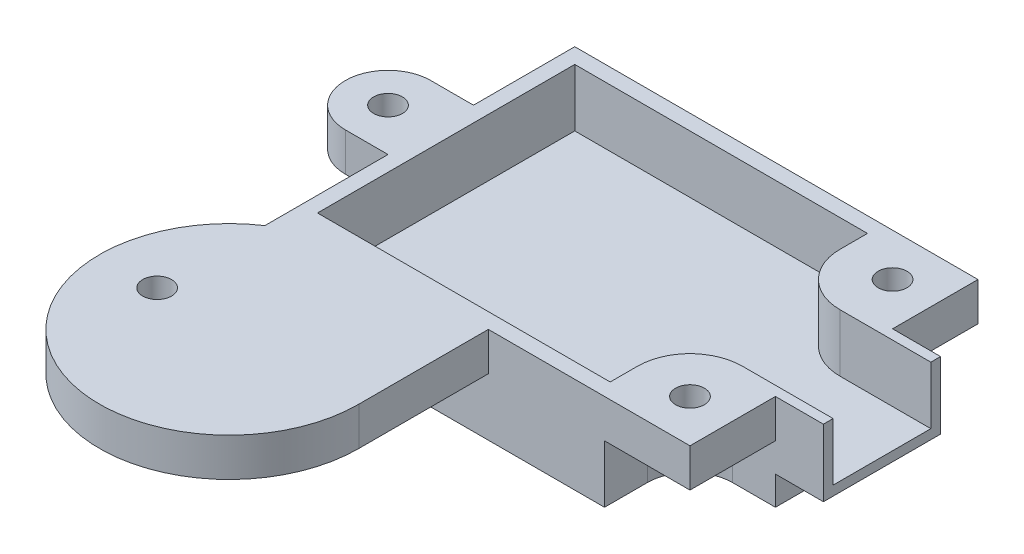
ISO-10303-21;
HEADER;
FILE_DESCRIPTION(('STEP AP214'),'2;1');
FILE_NAME('part.step','',(''),(''),'','','');
FILE_SCHEMA(('AUTOMOTIVE_DESIGN { 1 0 10303 214 1 1 1 1 }'));
ENDSEC;
DATA;
#1=APPLICATION_CONTEXT('core data for automotive mechanical design processes');
#2=APPLICATION_PROTOCOL_DEFINITION('international standard','automotive_design',2000,#1);
#3=PRODUCT_CONTEXT('',#1,'mechanical');
#4=PRODUCT('Part','Part','',(#3));
#5=PRODUCT_RELATED_PRODUCT_CATEGORY('part','',(#4));
#6=PRODUCT_DEFINITION_FORMATION('','',#4);
#7=PRODUCT_DEFINITION_CONTEXT('part definition',#1,'design');
#8=PRODUCT_DEFINITION('design','',#6,#7);
#9=PRODUCT_DEFINITION_SHAPE('','',#8);
#10=(LENGTH_UNIT() NAMED_UNIT(*) SI_UNIT(.MILLI.,.METRE.));
#11=(NAMED_UNIT(*) PLANE_ANGLE_UNIT() SI_UNIT($,.RADIAN.));
#12=(NAMED_UNIT(*) SI_UNIT($,.STERADIAN.) SOLID_ANGLE_UNIT());
#13=UNCERTAINTY_MEASURE_WITH_UNIT(LENGTH_MEASURE(1.E-05),#10,'distance_accuracy_value','');
#14=(GEOMETRIC_REPRESENTATION_CONTEXT(3) GLOBAL_UNCERTAINTY_ASSIGNED_CONTEXT((#13)) GLOBAL_UNIT_ASSIGNED_CONTEXT((#10,
#11,#12)) REPRESENTATION_CONTEXT('',''));
#15=CARTESIAN_POINT('',(0.,0.,0.));
#16=DIRECTION('',(0.,0.,1.));
#17=DIRECTION('',(1.,0.,0.));
#18=AXIS2_PLACEMENT_3D('',#15,#16,#17);
#19=CARTESIAN_POINT('',(42.,2.,0.));
#20=DIRECTION('',(-1.,0.,0.));
#21=DIRECTION('',(0.,0.,1.));
#22=AXIS2_PLACEMENT_3D('',#19,#20,#21);
#23=PLANE('',#22);
#24=DIRECTION('',(0.,-1.,0.));
#25=VECTOR('',#24,1.);
#26=CARTESIAN_POINT('',(42.,0.,-8.9));
#27=LINE('',#26,#25);
#28=CARTESIAN_POINT('',(42.,2.,-8.9));
#29=VERTEX_POINT('',#28);
#30=CARTESIAN_POINT('',(42.,-2.,-8.9));
#31=VERTEX_POINT('',#30);
#32=EDGE_CURVE('E282',#29,#31,#27,.T.);
#33=ORIENTED_EDGE('',*,*,#32,.F.);
#34=DIRECTION('',(0.,0.,-1.));
#35=VECTOR('',#34,1.);
#36=CARTESIAN_POINT('',(42.,2.,0.));
#37=LINE('',#36,#35);
#38=CARTESIAN_POINT('',(42.,2.,0.));
#39=VERTEX_POINT('',#38);
#40=EDGE_CURVE('E452',#39,#29,#37,.T.);
#41=ORIENTED_EDGE('',*,*,#40,.F.);
#42=DIRECTION('',(0.,-1.,0.));
#43=VECTOR('',#42,1.);
#44=CARTESIAN_POINT('',(42.,2.,0.));
#45=LINE('',#44,#43);
#46=CARTESIAN_POINT('',(42.,-2.,0.));
#47=VERTEX_POINT('',#46);
#48=EDGE_CURVE('E513',#39,#47,#45,.T.);
#49=ORIENTED_EDGE('',*,*,#48,.T.);
#50=DIRECTION('',(0.,0.,-1.));
#51=VECTOR('',#50,1.);
#52=CARTESIAN_POINT('',(42.,-2.,0.));
#53=LINE('',#52,#51);
#54=EDGE_CURVE('E489',#47,#31,#53,.T.);
#55=ORIENTED_EDGE('',*,*,#54,.T.);
#56=EDGE_LOOP('',(#33,#41,#49,#55));
#57=FACE_BOUND('',#56,.T.);
#58=ADVANCED_FACE('F41',(#57),#23,.F.);
#59=DIRECTION('',(0.,1.,0.));
#60=VECTOR('',#59,1.);
#61=CARTESIAN_POINT('',(42.,0.,-21.1));
#62=LINE('',#61,#60);
#63=CARTESIAN_POINT('',(42.,-2.,-21.1));
#64=VERTEX_POINT('',#63);
#65=CARTESIAN_POINT('',(42.,2.,-21.1));
#66=VERTEX_POINT('',#65);
#67=EDGE_CURVE('E11',#64,#66,#62,.T.);
#68=ORIENTED_EDGE('',*,*,#67,.F.);
#69=CARTESIAN_POINT('',(42.,-2.,-30.));
#70=VERTEX_POINT('',#69);
#71=EDGE_CURVE('E488',#64,#70,#53,.T.);
#72=ORIENTED_EDGE('',*,*,#71,.T.);
#73=DIRECTION('',(0.,-1.,0.));
#74=VECTOR('',#73,1.);
#75=CARTESIAN_POINT('',(42.,2.,-30.));
#76=LINE('',#75,#74);
#77=CARTESIAN_POINT('',(42.,2.,-30.));
#78=VERTEX_POINT('',#77);
#79=EDGE_CURVE('E510',#78,#70,#76,.T.);
#80=ORIENTED_EDGE('',*,*,#79,.F.);
#81=EDGE_CURVE('E451',#66,#78,#37,.T.);
#82=ORIENTED_EDGE('',*,*,#81,.F.);
#83=EDGE_LOOP('',(#68,#72,#80,#82));
#84=FACE_BOUND('',#83,.T.);
#85=ADVANCED_FACE('F560',(#84),#23,.F.);
#86=DIRECTION('',(0.,1.,0.));
#87=VECTOR('',#86,1.);
#88=CARTESIAN_POINT('',(42.,-8.,-21.1));
#89=LINE('',#88,#87);
#90=CARTESIAN_POINT('',(42.,-8.,-21.1));
#91=VERTEX_POINT('',#90);
#92=CARTESIAN_POINT('',(42.,-5.,-21.1));
#93=VERTEX_POINT('',#92);
#94=EDGE_CURVE('E58',#91,#93,#89,.T.);
#95=ORIENTED_EDGE('',*,*,#94,.T.);
#96=DIRECTION('',(0.,0.,1.));
#97=VECTOR('',#96,1.);
#98=CARTESIAN_POINT('',(42.,-5.,0.));
#99=LINE('',#98,#97);
#100=CARTESIAN_POINT('',(42.,-5.,-8.9));
#101=VERTEX_POINT('',#100);
#102=EDGE_CURVE('E63',#93,#101,#99,.T.);
#103=ORIENTED_EDGE('',*,*,#102,.T.);
#104=DIRECTION('',(0.,1.,0.));
#105=VECTOR('',#104,1.);
#106=CARTESIAN_POINT('',(42.,-8.,-8.9));
#107=LINE('',#106,#105);
#108=CARTESIAN_POINT('',(42.,-8.,-8.9));
#109=VERTEX_POINT('',#108);
#110=EDGE_CURVE('E424',#109,#101,#107,.T.);
#111=ORIENTED_EDGE('',*,*,#110,.F.);
#112=DIRECTION('',(0.,0.,1.));
#113=VECTOR('',#112,1.);
#114=CARTESIAN_POINT('',(42.,-8.,0.));
#115=LINE('',#114,#113);
#116=EDGE_CURVE('E379',#91,#109,#115,.T.);
#117=ORIENTED_EDGE('',*,*,#116,.F.);
#118=EDGE_LOOP('',(#95,#103,#111,#117));
#119=FACE_BOUND('',#118,.T.);
#120=ADVANCED_FACE('F563',(#119),#23,.F.);
#121=CARTESIAN_POINT('',(0.,2.,0.));
#122=DIRECTION('',(0.,1.,0.));
#123=DIRECTION('',(0.,0.,1.));
#124=AXIS2_PLACEMENT_3D('',#121,#122,#123);
#125=PLANE('',#124);
#126=CARTESIAN_POINT('',(37.55,2.,-4.45));
#127=DIRECTION('',(0.,1.,0.));
#128=DIRECTION('',(0.,0.,1.));
#129=AXIS2_PLACEMENT_3D('',#126,#127,#128);
#130=CIRCLE('',#129,1.5);
#131=CARTESIAN_POINT('',(37.55,2.,-2.95));
#132=VERTEX_POINT('',#131);
#133=EDGE_CURVE('E458',#132,#132,#130,.F.);
#134=ORIENTED_EDGE('',*,*,#133,.T.);
#135=EDGE_LOOP('',(#134));
#136=FACE_BOUND('',#135,.T.);
#137=CARTESIAN_POINT('',(37.55,2.,-25.55));
#138=DIRECTION('',(0.,1.,0.));
#139=DIRECTION('',(0.,0.,1.));
#140=AXIS2_PLACEMENT_3D('',#137,#138,#139);
#141=CIRCLE('',#140,1.5);
#142=CARTESIAN_POINT('',(37.55,2.,-24.05));
#143=VERTEX_POINT('',#142);
#144=EDGE_CURVE('E461',#143,#143,#141,.T.);
#145=ORIENTED_EDGE('',*,*,#144,.F.);
#146=EDGE_LOOP('',(#145));
#147=FACE_BOUND('',#146,.T.);
#148=CARTESIAN_POINT('',(-4.45,2.,-15.));
#149=DIRECTION('',(0.,1.,0.));
#150=DIRECTION('',(0.,0.,1.));
#151=AXIS2_PLACEMENT_3D('',#148,#149,#150);
#152=CIRCLE('',#151,1.5);
#153=CARTESIAN_POINT('',(-4.45,2.,-13.5));
#154=VERTEX_POINT('',#153);
#155=EDGE_CURVE('E464',#154,#154,#152,.T.);
#156=ORIENTED_EDGE('',*,*,#155,.F.);
#157=EDGE_LOOP('',(#156));
#158=FACE_BOUND('',#157,.T.);
#159=CARTESIAN_POINT('',(0.,2.,13.5));
#160=DIRECTION('',(0.,1.,0.));
#161=DIRECTION('',(0.,0.,1.));
#162=AXIS2_PLACEMENT_3D('',#159,#160,#161);
#163=CIRCLE('',#162,1.5);
#164=CARTESIAN_POINT('',(0.,2.,15.));
#165=VERTEX_POINT('',#164);
#166=EDGE_CURVE('E467',#165,#165,#163,.T.);
#167=ORIENTED_EDGE('',*,*,#166,.F.);
#168=EDGE_LOOP('',(#167));
#169=FACE_BOUND('',#168,.T.);
#170=CARTESIAN_POINT('',(37.55,2.,-25.55));
#171=DIRECTION('',(0.,1.,0.));
#172=DIRECTION('',(0.,0.,1.));
#173=AXIS2_PLACEMENT_3D('',#170,#171,#172);
#174=CIRCLE('',#173,5.46152532882695);
#175=CARTESIAN_POINT('',(32.088474671173,2.,-25.55));
#176=VERTEX_POINT('',#175);
#177=CARTESIAN_POINT('',(37.55,2.,-20.088474671173));
#178=VERTEX_POINT('',#177);
#179=EDGE_CURVE('E331',#176,#178,#174,.T.);
#180=ORIENTED_EDGE('',*,*,#179,.T.);
#181=DIRECTION('',(1.,0.,0.));
#182=VECTOR('',#181,1.);
#183=CARTESIAN_POINT('',(0.,2.,-20.088474671173));
#184=LINE('',#183,#182);
#185=CARTESIAN_POINT('',(47.,2.,-20.088474671173));
#186=VERTEX_POINT('',#185);
#187=EDGE_CURVE('E265',#178,#186,#184,.T.);
#188=ORIENTED_EDGE('',*,*,#187,.T.);
#189=DIRECTION('',(0.,0.,1.));
#190=VECTOR('',#189,1.);
#191=CARTESIAN_POINT('',(47.,2.,0.));
#192=LINE('',#191,#190);
#193=CARTESIAN_POINT('',(47.,2.,-21.1));
#194=VERTEX_POINT('',#193);
#195=EDGE_CURVE('E276',#194,#186,#192,.T.);
#196=ORIENTED_EDGE('',*,*,#195,.F.);
#197=DIRECTION('',(-1.,0.,0.));
#198=VECTOR('',#197,1.);
#199=CARTESIAN_POINT('',(47.,2.,-21.1));
#200=LINE('',#199,#198);
#201=EDGE_CURVE('E266',#194,#66,#200,.T.);
#202=ORIENTED_EDGE('',*,*,#201,.T.);
#203=ORIENTED_EDGE('',*,*,#81,.T.);
#204=DIRECTION('',(1.,0.,0.));
#205=VECTOR('',#204,1.);
#206=CARTESIAN_POINT('',(0.,2.,-30.));
#207=LINE('',#206,#205);
#208=CARTESIAN_POINT('',(0.,2.,-30.));
#209=VERTEX_POINT('',#208);
#210=EDGE_CURVE('E455',#209,#78,#207,.T.);
#211=ORIENTED_EDGE('',*,*,#210,.F.);
#212=DIRECTION('',(0.,0.,-1.));
#213=VECTOR('',#212,1.);
#214=CARTESIAN_POINT('',(0.,2.,0.));
#215=LINE('',#214,#213);
#216=CARTESIAN_POINT('',(0.,2.,-19.45));
#217=VERTEX_POINT('',#216);
#218=EDGE_CURVE('E445',#217,#209,#215,.T.);
#219=ORIENTED_EDGE('',*,*,#218,.F.);
#220=DIRECTION('',(1.,0.,0.));
#221=VECTOR('',#220,1.);
#222=CARTESIAN_POINT('',(0.,2.,-19.45));
#223=LINE('',#222,#221);
#224=CARTESIAN_POINT('',(-4.45,2.,-19.45));
#225=VERTEX_POINT('',#224);
#226=EDGE_CURVE('E433',#225,#217,#223,.T.);
#227=ORIENTED_EDGE('',*,*,#226,.F.);
#228=CARTESIAN_POINT('',(-4.45,2.,-15.));
#229=DIRECTION('',(0.,1.,0.));
#230=DIRECTION('',(0.,0.,1.));
#231=AXIS2_PLACEMENT_3D('',#228,#229,#230);
#232=CIRCLE('',#231,4.45);
#233=CARTESIAN_POINT('',(-4.45,2.,-10.55));
#234=VERTEX_POINT('',#233);
#235=EDGE_CURVE('E436',#225,#234,#232,.T.);
#236=ORIENTED_EDGE('',*,*,#235,.T.);
#237=DIRECTION('',(1.,0.,0.));
#238=VECTOR('',#237,1.);
#239=CARTESIAN_POINT('',(0.,2.,-10.55));
#240=LINE('',#239,#238);
#241=CARTESIAN_POINT('',(0.,2.,-10.55));
#242=VERTEX_POINT('',#241);
#243=EDGE_CURVE('E439',#234,#242,#240,.T.);
#244=ORIENTED_EDGE('',*,*,#243,.T.);
#245=CARTESIAN_POINT('',(0.,2.,2.27502783967818));
#246=VERTEX_POINT('',#245);
#247=EDGE_CURVE('E441',#246,#242,#215,.T.);
#248=ORIENTED_EDGE('',*,*,#247,.F.);
#249=CARTESIAN_POINT('',(7.5,2.,13.5));
#250=DIRECTION('',(0.,1.,0.));
#251=DIRECTION('',(0.,0.,1.));
#252=AXIS2_PLACEMENT_3D('',#249,#250,#251);
#253=CIRCLE('',#252,13.5);
#254=CARTESIAN_POINT('',(21.,2.,13.5));
#255=VERTEX_POINT('',#254);
#256=EDGE_CURVE('E444',#246,#255,#253,.T.);
#257=ORIENTED_EDGE('',*,*,#256,.T.);
#258=DIRECTION('',(0.,0.,-1.));
#259=VECTOR('',#258,1.);
#260=CARTESIAN_POINT('',(21.,2.,0.));
#261=LINE('',#260,#259);
#262=CARTESIAN_POINT('',(21.,2.,0.));
#263=VERTEX_POINT('',#262);
#264=EDGE_CURVE('E447',#255,#263,#261,.T.);
#265=ORIENTED_EDGE('',*,*,#264,.T.);
#266=DIRECTION('',(1.,0.,0.));
#267=VECTOR('',#266,1.);
#268=CARTESIAN_POINT('',(0.,2.,0.));
#269=LINE('',#268,#267);
#270=EDGE_CURVE('E449',#263,#39,#269,.T.);
#271=ORIENTED_EDGE('',*,*,#270,.T.);
#272=ORIENTED_EDGE('',*,*,#40,.T.);
#273=DIRECTION('',(-1.,0.,0.));
#274=VECTOR('',#273,1.);
#275=CARTESIAN_POINT('',(47.,2.,-8.9));
#276=LINE('',#275,#274);
#277=CARTESIAN_POINT('',(47.,2.,-8.9));
#278=VERTEX_POINT('',#277);
#279=EDGE_CURVE('E303',#278,#29,#276,.T.);
#280=ORIENTED_EDGE('',*,*,#279,.F.);
#281=DIRECTION('',(0.,0.,1.));
#282=VECTOR('',#281,1.);
#283=CARTESIAN_POINT('',(47.,2.,0.));
#284=LINE('',#283,#282);
#285=CARTESIAN_POINT('',(47.,2.,-9.91152532882695));
#286=VERTEX_POINT('',#285);
#287=EDGE_CURVE('E297',#286,#278,#284,.T.);
#288=ORIENTED_EDGE('',*,*,#287,.F.);
#289=DIRECTION('',(1.,0.,0.));
#290=VECTOR('',#289,1.);
#291=CARTESIAN_POINT('',(0.,2.,-9.91152532882695));
#292=LINE('',#291,#290);
#293=CARTESIAN_POINT('',(37.55,2.,-9.91152532882695));
#294=VERTEX_POINT('',#293);
#295=EDGE_CURVE('E310',#294,#286,#292,.T.);
#296=ORIENTED_EDGE('',*,*,#295,.F.);
#297=CARTESIAN_POINT('',(37.55,2.,-4.45));
#298=DIRECTION('',(0.,1.,0.));
#299=DIRECTION('',(0.,0.,1.));
#300=AXIS2_PLACEMENT_3D('',#297,#298,#299);
#301=CIRCLE('',#300,5.46152532882695);
#302=CARTESIAN_POINT('',(32.088474671173,2.,-4.45));
#303=VERTEX_POINT('',#302);
#304=EDGE_CURVE('E349',#294,#303,#301,.T.);
#305=ORIENTED_EDGE('',*,*,#304,.T.);
#306=DIRECTION('',(0.,0.,-1.));
#307=VECTOR('',#306,1.);
#308=CARTESIAN_POINT('',(32.088474671173,2.,0.));
#309=LINE('',#308,#307);
#310=CARTESIAN_POINT('',(32.088474671173,2.,-1.6));
#311=VERTEX_POINT('',#310);
#312=EDGE_CURVE('E346',#311,#303,#309,.T.);
#313=ORIENTED_EDGE('',*,*,#312,.F.);
#314=DIRECTION('',(1.,0.,0.));
#315=VECTOR('',#314,1.);
#316=CARTESIAN_POINT('',(0.,2.,-1.6));
#317=LINE('',#316,#315);
#318=CARTESIAN_POINT('',(1.6,2.,-1.6));
#319=VERTEX_POINT('',#318);
#320=EDGE_CURVE('E343',#319,#311,#317,.T.);
#321=ORIENTED_EDGE('',*,*,#320,.F.);
#322=DIRECTION('',(0.,0.,1.));
#323=VECTOR('',#322,1.);
#324=CARTESIAN_POINT('',(1.6,2.,0.));
#325=LINE('',#324,#323);
#326=CARTESIAN_POINT('',(1.6,2.,-28.4));
#327=VERTEX_POINT('',#326);
#328=EDGE_CURVE('E340',#327,#319,#325,.T.);
#329=ORIENTED_EDGE('',*,*,#328,.F.);
#330=DIRECTION('',(1.,0.,0.));
#331=VECTOR('',#330,1.);
#332=CARTESIAN_POINT('',(0.,2.,-28.4));
#333=LINE('',#332,#331);
#334=CARTESIAN_POINT('',(32.088474671173,2.,-28.4));
#335=VERTEX_POINT('',#334);
#336=EDGE_CURVE('E337',#327,#335,#333,.T.);
#337=ORIENTED_EDGE('',*,*,#336,.T.);
#338=DIRECTION('',(0.,0.,1.));
#339=VECTOR('',#338,1.);
#340=CARTESIAN_POINT('',(32.0884746711731,2.,0.));
#341=LINE('',#340,#339);
#342=EDGE_CURVE('E334',#335,#176,#341,.T.);
#343=ORIENTED_EDGE('',*,*,#342,.T.);
#344=EDGE_LOOP('',(#180,#188,#196,#202,#203,#211,#219,#227,#236,#244,#248,#257,#265,#271,#272,
#280,#288,#296,#305,#313,#321,#329,#337,#343));
#345=FACE_BOUND('',#344,.T.);
#346=ADVANCED_FACE('F572',(#136,#147,#158,#169,#345),#125,.T.);
#347=CARTESIAN_POINT('',(0.,-2.,0.));
#348=DIRECTION('',(0.,1.,0.));
#349=DIRECTION('',(0.,0.,1.));
#350=AXIS2_PLACEMENT_3D('',#347,#348,#349);
#351=PLANE('',#350);
#352=DIRECTION('',(0.,0.,-1.));
#353=VECTOR('',#352,1.);
#354=CARTESIAN_POINT('',(0.,-2.,0.));
#355=LINE('',#354,#353);
#356=CARTESIAN_POINT('',(0.,-2.,-10.55));
#357=VERTEX_POINT('',#356);
#358=CARTESIAN_POINT('',(0.,-2.,-19.45));
#359=VERTEX_POINT('',#358);
#360=EDGE_CURVE('E50',#357,#359,#355,.T.);
#361=ORIENTED_EDGE('',*,*,#360,.F.);
#362=DIRECTION('',(1.,0.,0.));
#363=VECTOR('',#362,1.);
#364=CARTESIAN_POINT('',(0.,-2.,-10.55));
#365=LINE('',#364,#363);
#366=CARTESIAN_POINT('',(-4.45,-2.,-10.55));
#367=VERTEX_POINT('',#366);
#368=EDGE_CURVE('E475',#367,#357,#365,.T.);
#369=ORIENTED_EDGE('',*,*,#368,.F.);
#370=CARTESIAN_POINT('',(-4.45,-2.,-15.));
#371=DIRECTION('',(0.,1.,0.));
#372=DIRECTION('',(0.,0.,1.));
#373=AXIS2_PLACEMENT_3D('',#370,#371,#372);
#374=CIRCLE('',#373,4.45);
#375=CARTESIAN_POINT('',(-4.45,-2.,-19.45));
#376=VERTEX_POINT('',#375);
#377=EDGE_CURVE('E473',#376,#367,#374,.T.);
#378=ORIENTED_EDGE('',*,*,#377,.F.);
#379=DIRECTION('',(1.,0.,0.));
#380=VECTOR('',#379,1.);
#381=CARTESIAN_POINT('',(0.,-2.,-19.45));
#382=LINE('',#381,#380);
#383=EDGE_CURVE('E432',#376,#359,#382,.T.);
#384=ORIENTED_EDGE('',*,*,#383,.T.);
#385=EDGE_LOOP('',(#361,#369,#378,#384));
#386=FACE_BOUND('',#385,.T.);
#387=CARTESIAN_POINT('',(-4.45,-2.,-15.));
#388=DIRECTION('',(0.,1.,0.));
#389=DIRECTION('',(0.,0.,1.));
#390=AXIS2_PLACEMENT_3D('',#387,#388,#389);
#391=CIRCLE('',#390,1.5);
#392=CARTESIAN_POINT('',(-4.45,-2.,-13.5));
#393=VERTEX_POINT('',#392);
#394=EDGE_CURVE('E501',#393,#393,#391,.T.);
#395=ORIENTED_EDGE('',*,*,#394,.T.);
#396=EDGE_LOOP('',(#395));
#397=FACE_BOUND('',#396,.T.);
#398=ADVANCED_FACE('F540',(#386,#397),#351,.F.);
#399=DIRECTION('',(-1.,0.,0.));
#400=VECTOR('',#399,1.);
#401=CARTESIAN_POINT('',(0.,-2.,0.));
#402=LINE('',#401,#400);
#403=CARTESIAN_POINT('',(21.,-2.,0.));
#404=VERTEX_POINT('',#403);
#405=CARTESIAN_POINT('',(0.,-2.,0.));
#406=VERTEX_POINT('',#405);
#407=EDGE_CURVE('E410',#404,#406,#402,.T.);
#408=ORIENTED_EDGE('',*,*,#407,.F.);
#409=DIRECTION('',(0.,0.,-1.));
#410=VECTOR('',#409,1.);
#411=CARTESIAN_POINT('',(21.,-2.,0.));
#412=LINE('',#411,#410);
#413=CARTESIAN_POINT('',(21.,-2.,13.5));
#414=VERTEX_POINT('',#413);
#415=EDGE_CURVE('E483',#414,#404,#412,.T.);
#416=ORIENTED_EDGE('',*,*,#415,.F.);
#417=CARTESIAN_POINT('',(7.5,-2.,13.5));
#418=DIRECTION('',(0.,1.,0.));
#419=DIRECTION('',(0.,0.,1.));
#420=AXIS2_PLACEMENT_3D('',#417,#418,#419);
#421=CIRCLE('',#420,13.5);
#422=CARTESIAN_POINT('',(0.,-2.,2.27502783967818));
#423=VERTEX_POINT('',#422);
#424=EDGE_CURVE('E481',#423,#414,#421,.T.);
#425=ORIENTED_EDGE('',*,*,#424,.F.);
#426=DIRECTION('',(0.,0.,-1.));
#427=VECTOR('',#426,1.);
#428=CARTESIAN_POINT('',(0.,-2.,0.));
#429=LINE('',#428,#427);
#430=EDGE_CURVE('E478',#423,#406,#429,.T.);
#431=ORIENTED_EDGE('',*,*,#430,.T.);
#432=EDGE_LOOP('',(#408,#416,#425,#431));
#433=FACE_BOUND('',#432,.T.);
#434=CARTESIAN_POINT('',(0.,-2.,13.5));
#435=DIRECTION('',(0.,1.,0.));
#436=DIRECTION('',(0.,0.,1.));
#437=AXIS2_PLACEMENT_3D('',#434,#435,#436);
#438=CIRCLE('',#437,1.5);
#439=CARTESIAN_POINT('',(0.,-2.,15.));
#440=VERTEX_POINT('',#439);
#441=EDGE_CURVE('E437',#440,#440,#438,.T.);
#442=ORIENTED_EDGE('',*,*,#441,.T.);
#443=EDGE_LOOP('',(#442));
#444=FACE_BOUND('',#443,.T.);
#445=ADVANCED_FACE('F584',(#433,#444),#351,.F.);
#446=CARTESIAN_POINT('',(37.55,-2.,-25.55));
#447=DIRECTION('',(0.,1.,0.));
#448=DIRECTION('',(0.,0.,1.));
#449=AXIS2_PLACEMENT_3D('',#446,#447,#448);
#450=CIRCLE('',#449,1.5);
#451=CARTESIAN_POINT('',(37.55,-2.,-24.05));
#452=VERTEX_POINT('',#451);
#453=EDGE_CURVE('E498',#452,#452,#450,.T.);
#454=ORIENTED_EDGE('',*,*,#453,.T.);
#455=EDGE_LOOP('',(#454));
#456=FACE_BOUND('',#455,.T.);
#457=CARTESIAN_POINT('',(37.55,-2.,-25.55));
#458=DIRECTION('',(0.,-1.,0.));
#459=DIRECTION('',(0.,0.,-1.));
#460=AXIS2_PLACEMENT_3D('',#457,#458,#459);
#461=CIRCLE('',#460,4.45);
#462=CARTESIAN_POINT('',(37.55,-2.,-21.1));
#463=VERTEX_POINT('',#462);
#464=CARTESIAN_POINT('',(33.1,-2.,-25.55));
#465=VERTEX_POINT('',#464);
#466=EDGE_CURVE('E399',#463,#465,#461,.T.);
#467=ORIENTED_EDGE('',*,*,#466,.T.);
#468=DIRECTION('',(0.,0.,-1.));
#469=VECTOR('',#468,1.);
#470=CARTESIAN_POINT('',(33.1,-2.,0.));
#471=LINE('',#470,#469);
#472=CARTESIAN_POINT('',(33.1,-2.,-30.));
#473=VERTEX_POINT('',#472);
#474=EDGE_CURVE('E355',#465,#473,#471,.T.);
#475=ORIENTED_EDGE('',*,*,#474,.T.);
#476=DIRECTION('',(1.,0.,0.));
#477=VECTOR('',#476,1.);
#478=CARTESIAN_POINT('',(0.,-2.,-30.));
#479=LINE('',#478,#477);
#480=EDGE_CURVE('E492',#473,#70,#479,.T.);
#481=ORIENTED_EDGE('',*,*,#480,.T.);
#482=ORIENTED_EDGE('',*,*,#71,.F.);
#483=DIRECTION('',(1.,0.,0.));
#484=VECTOR('',#483,1.);
#485=CARTESIAN_POINT('',(0.,-2.,-21.1));
#486=LINE('',#485,#484);
#487=EDGE_CURVE('E402',#463,#64,#486,.T.);
#488=ORIENTED_EDGE('',*,*,#487,.F.);
#489=EDGE_LOOP('',(#467,#475,#481,#482,#488));
#490=FACE_BOUND('',#489,.T.);
#491=ADVANCED_FACE('F595',(#456,#490),#351,.F.);
#492=CARTESIAN_POINT('',(0.,2.,-19.45));
#493=DIRECTION('',(0.,0.,-1.));
#494=DIRECTION('',(-1.,0.,0.));
#495=AXIS2_PLACEMENT_3D('',#492,#493,#494);
#496=PLANE('',#495);
#497=ORIENTED_EDGE('',*,*,#383,.F.);
#498=DIRECTION('',(0.,-1.,0.));
#499=VECTOR('',#498,1.);
#500=CARTESIAN_POINT('',(-4.45,2.,-19.45));
#501=LINE('',#500,#499);
#502=EDGE_CURVE('E45',#225,#376,#501,.T.);
#503=ORIENTED_EDGE('',*,*,#502,.F.);
#504=ORIENTED_EDGE('',*,*,#226,.T.);
#505=DIRECTION('',(0.,-1.,0.));
#506=VECTOR('',#505,1.);
#507=CARTESIAN_POINT('',(0.,2.,-19.45));
#508=LINE('',#507,#506);
#509=EDGE_CURVE('E470',#217,#359,#508,.T.);
#510=ORIENTED_EDGE('',*,*,#509,.T.);
#511=EDGE_LOOP('',(#497,#503,#504,#510));
#512=FACE_BOUND('',#511,.T.);
#513=ADVANCED_FACE('F43',(#512),#496,.T.);
#514=CARTESIAN_POINT('',(-4.45,2.,-15.));
#515=DIRECTION('',(0.,-1.,0.));
#516=DIRECTION('',(0.,0.,-1.));
#517=AXIS2_PLACEMENT_3D('',#514,#515,#516);
#518=CYLINDRICAL_SURFACE('',#517,4.45);
#519=ORIENTED_EDGE('',*,*,#377,.T.);
#520=DIRECTION('',(0.,-1.,0.));
#521=VECTOR('',#520,1.);
#522=CARTESIAN_POINT('',(-4.45,2.,-10.55));
#523=LINE('',#522,#521);
#524=EDGE_CURVE('E526',#234,#367,#523,.T.);
#525=ORIENTED_EDGE('',*,*,#524,.F.);
#526=ORIENTED_EDGE('',*,*,#235,.F.);
#527=ORIENTED_EDGE('',*,*,#502,.T.);
#528=EDGE_LOOP('',(#519,#525,#526,#527));
#529=FACE_BOUND('',#528,.T.);
#530=ADVANCED_FACE('F535',(#529),#518,.T.);
#531=CARTESIAN_POINT('',(0.,2.,-10.55));
#532=DIRECTION('',(0.,0.,-1.));
#533=DIRECTION('',(-1.,0.,0.));
#534=AXIS2_PLACEMENT_3D('',#531,#532,#533);
#535=PLANE('',#534);
#536=ORIENTED_EDGE('',*,*,#368,.T.);
#537=DIRECTION('',(0.,-1.,0.));
#538=VECTOR('',#537,1.);
#539=CARTESIAN_POINT('',(0.,2.,-10.55));
#540=LINE('',#539,#538);
#541=EDGE_CURVE('E524',#242,#357,#540,.T.);
#542=ORIENTED_EDGE('',*,*,#541,.F.);
#543=ORIENTED_EDGE('',*,*,#243,.F.);
#544=ORIENTED_EDGE('',*,*,#524,.T.);
#545=EDGE_LOOP('',(#536,#542,#543,#544));
#546=FACE_BOUND('',#545,.T.);
#547=ADVANCED_FACE('F548',(#546),#535,.F.);
#548=CARTESIAN_POINT('',(7.5,2.,13.5));
#549=DIRECTION('',(0.,-1.,0.));
#550=DIRECTION('',(0.,0.,-1.));
#551=AXIS2_PLACEMENT_3D('',#548,#549,#550);
#552=CYLINDRICAL_SURFACE('',#551,13.5);
#553=ORIENTED_EDGE('',*,*,#424,.T.);
#554=DIRECTION('',(0.,-1.,0.));
#555=VECTOR('',#554,1.);
#556=CARTESIAN_POINT('',(21.,2.,13.5));
#557=LINE('',#556,#555);
#558=EDGE_CURVE('E519',#255,#414,#557,.T.);
#559=ORIENTED_EDGE('',*,*,#558,.F.);
#560=ORIENTED_EDGE('',*,*,#256,.F.);
#561=DIRECTION('',(0.,-1.,0.));
#562=VECTOR('',#561,1.);
#563=CARTESIAN_POINT('',(0.,2.,2.27502783967818));
#564=LINE('',#563,#562);
#565=EDGE_CURVE('E522',#246,#423,#564,.T.);
#566=ORIENTED_EDGE('',*,*,#565,.T.);
#567=EDGE_LOOP('',(#553,#559,#560,#566));
#568=FACE_BOUND('',#567,.T.);
#569=ADVANCED_FACE('F550',(#568),#552,.T.);
#570=CARTESIAN_POINT('',(21.,2.,0.));
#571=DIRECTION('',(-1.,0.,0.));
#572=DIRECTION('',(0.,0.,1.));
#573=AXIS2_PLACEMENT_3D('',#570,#571,#572);
#574=PLANE('',#573);
#575=ORIENTED_EDGE('',*,*,#415,.T.);
#576=DIRECTION('',(0.,-1.,0.));
#577=VECTOR('',#576,1.);
#578=CARTESIAN_POINT('',(21.,2.,0.));
#579=LINE('',#578,#577);
#580=EDGE_CURVE('E516',#263,#404,#579,.T.);
#581=ORIENTED_EDGE('',*,*,#580,.F.);
#582=ORIENTED_EDGE('',*,*,#264,.F.);
#583=ORIENTED_EDGE('',*,*,#558,.T.);
#584=EDGE_LOOP('',(#575,#581,#582,#583));
#585=FACE_BOUND('',#584,.T.);
#586=ADVANCED_FACE('F556',(#585),#574,.F.);
#587=CARTESIAN_POINT('',(0.,2.,0.));
#588=DIRECTION('',(0.,0.,-1.));
#589=DIRECTION('',(-1.,0.,0.));
#590=AXIS2_PLACEMENT_3D('',#587,#588,#589);
#591=PLANE('',#590);
#592=ORIENTED_EDGE('',*,*,#580,.T.);
#593=ORIENTED_EDGE('',*,*,#407,.T.);
#594=DIRECTION('',(0.,1.,0.));
#595=VECTOR('',#594,1.);
#596=CARTESIAN_POINT('',(0.,-8.,0.));
#597=LINE('',#596,#595);
#598=CARTESIAN_POINT('',(0.,-8.,0.));
#599=VERTEX_POINT('',#598);
#600=EDGE_CURVE('E414',#599,#406,#597,.T.);
#601=ORIENTED_EDGE('',*,*,#600,.F.);
#602=DIRECTION('',(-1.,0.,0.));
#603=VECTOR('',#602,1.);
#604=CARTESIAN_POINT('',(0.,-8.,0.));
#605=LINE('',#604,#603);
#606=CARTESIAN_POINT('',(33.1,-8.,0.));
#607=VERTEX_POINT('',#606);
#608=EDGE_CURVE('E389',#607,#599,#605,.T.);
#609=ORIENTED_EDGE('',*,*,#608,.F.);
#610=DIRECTION('',(0.,1.,0.));
#611=VECTOR('',#610,1.);
#612=CARTESIAN_POINT('',(33.1,-8.,0.));
#613=LINE('',#612,#611);
#614=CARTESIAN_POINT('',(33.1,-2.,0.));
#615=VERTEX_POINT('',#614);
#616=EDGE_CURVE('E417',#607,#615,#613,.T.);
#617=ORIENTED_EDGE('',*,*,#616,.T.);
#618=DIRECTION('',(1.,0.,0.));
#619=VECTOR('',#618,1.);
#620=CARTESIAN_POINT('',(0.,-2.,0.));
#621=LINE('',#620,#619);
#622=EDGE_CURVE('E486',#615,#47,#621,.T.);
#623=ORIENTED_EDGE('',*,*,#622,.T.);
#624=ORIENTED_EDGE('',*,*,#48,.F.);
#625=ORIENTED_EDGE('',*,*,#270,.F.);
#626=EDGE_LOOP('',(#592,#593,#601,#609,#617,#623,#624,#625));
#627=FACE_BOUND('',#626,.T.);
#628=ADVANCED_FACE('F614',(#627),#591,.F.);
#629=CARTESIAN_POINT('',(0.,2.,-30.));
#630=DIRECTION('',(0.,0.,-1.));
#631=DIRECTION('',(-1.,0.,0.));
#632=AXIS2_PLACEMENT_3D('',#629,#630,#631);
#633=PLANE('',#632);
#634=ORIENTED_EDGE('',*,*,#480,.F.);
#635=DIRECTION('',(0.,1.,0.));
#636=VECTOR('',#635,1.);
#637=CARTESIAN_POINT('',(33.1,-8.,-30.));
#638=LINE('',#637,#636);
#639=CARTESIAN_POINT('',(33.1,-8.,-30.));
#640=VERTEX_POINT('',#639);
#641=EDGE_CURVE('E396',#640,#473,#638,.T.);
#642=ORIENTED_EDGE('',*,*,#641,.F.);
#643=DIRECTION('',(1.,0.,0.));
#644=VECTOR('',#643,1.);
#645=CARTESIAN_POINT('',(0.,-8.,-30.));
#646=LINE('',#645,#644);
#647=CARTESIAN_POINT('',(0.,-8.,-30.));
#648=VERTEX_POINT('',#647);
#649=EDGE_CURVE('E394',#648,#640,#646,.T.);
#650=ORIENTED_EDGE('',*,*,#649,.F.);
#651=DIRECTION('',(0.,-1.,0.));
#652=VECTOR('',#651,1.);
#653=CARTESIAN_POINT('',(0.,2.,-30.));
#654=LINE('',#653,#652);
#655=EDGE_CURVE('E508',#209,#648,#654,.T.);
#656=ORIENTED_EDGE('',*,*,#655,.F.);
#657=ORIENTED_EDGE('',*,*,#210,.T.);
#658=ORIENTED_EDGE('',*,*,#79,.T.);
#659=EDGE_LOOP('',(#634,#642,#650,#656,#657,#658));
#660=FACE_BOUND('',#659,.T.);
#661=ADVANCED_FACE('F603',(#660),#633,.T.);
#662=CARTESIAN_POINT('',(-4.45,2.,-15.));
#663=DIRECTION('',(0.,-1.,0.));
#664=DIRECTION('',(0.,0.,-1.));
#665=AXIS2_PLACEMENT_3D('',#662,#663,#664);
#666=CYLINDRICAL_SURFACE('',#665,1.5);
#667=ORIENTED_EDGE('',*,*,#155,.T.);
#668=EDGE_LOOP('',(#667));
#669=FACE_BOUND('',#668,.T.);
#670=ORIENTED_EDGE('',*,*,#394,.F.);
#671=EDGE_LOOP('',(#670));
#672=FACE_BOUND('',#671,.T.);
#673=ADVANCED_FACE('F599',(#669,#672),#666,.F.);
#674=CARTESIAN_POINT('',(37.55,2.,-25.55));
#675=DIRECTION('',(0.,-1.,0.));
#676=DIRECTION('',(0.,0.,-1.));
#677=AXIS2_PLACEMENT_3D('',#674,#675,#676);
#678=CYLINDRICAL_SURFACE('',#677,1.5);
#679=ORIENTED_EDGE('',*,*,#144,.T.);
#680=EDGE_LOOP('',(#679));
#681=FACE_BOUND('',#680,.T.);
#682=ORIENTED_EDGE('',*,*,#453,.F.);
#683=EDGE_LOOP('',(#682));
#684=FACE_BOUND('',#683,.T.);
#685=ADVANCED_FACE('F602',(#681,#684),#678,.F.);
#686=CARTESIAN_POINT('',(37.55,2.,-4.45));
#687=DIRECTION('',(0.,-1.,0.));
#688=DIRECTION('',(0.,0.,-1.));
#689=AXIS2_PLACEMENT_3D('',#686,#687,#688);
#690=CYLINDRICAL_SURFACE('',#689,1.5);
#691=ORIENTED_EDGE('',*,*,#133,.F.);
#692=EDGE_LOOP('',(#691));
#693=FACE_BOUND('',#692,.T.);
#694=CARTESIAN_POINT('',(37.55,-2.,-4.45));
#695=DIRECTION('',(0.,1.,0.));
#696=DIRECTION('',(0.,0.,1.));
#697=AXIS2_PLACEMENT_3D('',#694,#695,#696);
#698=CIRCLE('',#697,1.5);
#699=CARTESIAN_POINT('',(37.55,-2.,-2.95));
#700=VERTEX_POINT('',#699);
#701=EDGE_CURVE('E495',#700,#700,#698,.F.);
#702=ORIENTED_EDGE('',*,*,#701,.T.);
#703=EDGE_LOOP('',(#702));
#704=FACE_BOUND('',#703,.T.);
#705=ADVANCED_FACE('F607',(#693,#704),#690,.F.);
#706=CARTESIAN_POINT('',(0.,2.,0.));
#707=DIRECTION('',(-1.,0.,0.));
#708=DIRECTION('',(0.,0.,1.));
#709=AXIS2_PLACEMENT_3D('',#706,#707,#708);
#710=PLANE('',#709);
#711=ORIENTED_EDGE('',*,*,#655,.T.);
#712=DIRECTION('',(0.,0.,-1.));
#713=VECTOR('',#712,1.);
#714=CARTESIAN_POINT('',(0.,-8.,0.));
#715=LINE('',#714,#713);
#716=EDGE_CURVE('E391',#599,#648,#715,.T.);
#717=ORIENTED_EDGE('',*,*,#716,.F.);
#718=ORIENTED_EDGE('',*,*,#600,.T.);
#719=ORIENTED_EDGE('',*,*,#430,.F.);
#720=ORIENTED_EDGE('',*,*,#565,.F.);
#721=ORIENTED_EDGE('',*,*,#247,.T.);
#722=ORIENTED_EDGE('',*,*,#541,.T.);
#723=ORIENTED_EDGE('',*,*,#360,.T.);
#724=ORIENTED_EDGE('',*,*,#509,.F.);
#725=ORIENTED_EDGE('',*,*,#218,.T.);
#726=EDGE_LOOP('',(#711,#717,#718,#719,#720,#721,#722,#723,#724,#725));
#727=FACE_BOUND('',#726,.T.);
#728=ADVANCED_FACE('F545',(#727),#710,.T.);
#729=CARTESIAN_POINT('',(0.,2.,13.5));
#730=DIRECTION('',(0.,-1.,0.));
#731=DIRECTION('',(0.,0.,-1.));
#732=AXIS2_PLACEMENT_3D('',#729,#730,#731);
#733=CYLINDRICAL_SURFACE('',#732,1.5);
#734=ORIENTED_EDGE('',*,*,#166,.T.);
#735=EDGE_LOOP('',(#734));
#736=FACE_BOUND('',#735,.T.);
#737=ORIENTED_EDGE('',*,*,#441,.F.);
#738=EDGE_LOOP('',(#737));
#739=FACE_BOUND('',#738,.T.);
#740=ADVANCED_FACE('F593',(#736,#739),#733,.F.);
#741=DIRECTION('',(0.,0.,1.));
#742=VECTOR('',#741,1.);
#743=CARTESIAN_POINT('',(33.1,-2.,0.));
#744=LINE('',#743,#742);
#745=CARTESIAN_POINT('',(33.1,-2.,-4.45));
#746=VERTEX_POINT('',#745);
#747=EDGE_CURVE('E374',#746,#615,#744,.T.);
#748=ORIENTED_EDGE('',*,*,#747,.F.);
#749=CARTESIAN_POINT('',(37.55,-2.,-4.45));
#750=DIRECTION('',(0.,-1.,0.));
#751=DIRECTION('',(0.,0.,-1.));
#752=AXIS2_PLACEMENT_3D('',#749,#750,#751);
#753=CIRCLE('',#752,4.45);
#754=CARTESIAN_POINT('',(37.55,-2.,-8.9));
#755=VERTEX_POINT('',#754);
#756=EDGE_CURVE('E406',#746,#755,#753,.T.);
#757=ORIENTED_EDGE('',*,*,#756,.T.);
#758=DIRECTION('',(1.,0.,0.));
#759=VECTOR('',#758,1.);
#760=CARTESIAN_POINT('',(0.,-2.,-8.90000000000001));
#761=LINE('',#760,#759);
#762=EDGE_CURVE('E404',#755,#31,#761,.T.);
#763=ORIENTED_EDGE('',*,*,#762,.T.);
#764=ORIENTED_EDGE('',*,*,#54,.F.);
#765=ORIENTED_EDGE('',*,*,#622,.F.);
#766=EDGE_LOOP('',(#748,#757,#763,#764,#765));
#767=FACE_BOUND('',#766,.T.);
#768=ORIENTED_EDGE('',*,*,#701,.F.);
#769=EDGE_LOOP('',(#768));
#770=FACE_BOUND('',#769,.T.);
#771=ADVANCED_FACE('F586',(#767,#770),#351,.F.);
#772=CARTESIAN_POINT('',(33.1,-8.,0.));
#773=DIRECTION('',(1.,0.,0.));
#774=DIRECTION('',(0.,0.,-1.));
#775=AXIS2_PLACEMENT_3D('',#772,#773,#774);
#776=PLANE('',#775);
#777=ORIENTED_EDGE('',*,*,#474,.F.);
#778=DIRECTION('',(0.,1.,0.));
#779=VECTOR('',#778,1.);
#780=CARTESIAN_POINT('',(33.1,-8.,-25.55));
#781=LINE('',#780,#779);
#782=CARTESIAN_POINT('',(33.1,-8.,-25.55));
#783=VERTEX_POINT('',#782);
#784=EDGE_CURVE('E429',#783,#465,#781,.T.);
#785=ORIENTED_EDGE('',*,*,#784,.F.);
#786=DIRECTION('',(0.,0.,-1.));
#787=VECTOR('',#786,1.);
#788=CARTESIAN_POINT('',(33.1,-8.,0.));
#789=LINE('',#788,#787);
#790=EDGE_CURVE('E370',#783,#640,#789,.T.);
#791=ORIENTED_EDGE('',*,*,#790,.T.);
#792=ORIENTED_EDGE('',*,*,#641,.T.);
#793=EDGE_LOOP('',(#777,#785,#791,#792));
#794=FACE_BOUND('',#793,.T.);
#795=ADVANCED_FACE('F589',(#794),#776,.T.);
#796=CARTESIAN_POINT('',(37.55,-8.,-25.55));
#797=DIRECTION('',(0.,1.,0.));
#798=DIRECTION('',(0.,0.,1.));
#799=AXIS2_PLACEMENT_3D('',#796,#797,#798);
#800=CYLINDRICAL_SURFACE('',#799,4.45);
#801=ORIENTED_EDGE('',*,*,#466,.F.);
#802=DIRECTION('',(0.,1.,0.));
#803=VECTOR('',#802,1.);
#804=CARTESIAN_POINT('',(37.55,-8.,-21.1));
#805=LINE('',#804,#803);
#806=CARTESIAN_POINT('',(37.55,-8.,-21.1));
#807=VERTEX_POINT('',#806);
#808=EDGE_CURVE('E427',#807,#463,#805,.T.);
#809=ORIENTED_EDGE('',*,*,#808,.F.);
#810=CARTESIAN_POINT('',(37.55,-8.,-25.55));
#811=DIRECTION('',(0.,-1.,0.));
#812=DIRECTION('',(0.,0.,-1.));
#813=AXIS2_PLACEMENT_3D('',#810,#811,#812);
#814=CIRCLE('',#813,4.45);
#815=EDGE_CURVE('E373',#807,#783,#814,.T.);
#816=ORIENTED_EDGE('',*,*,#815,.T.);
#817=ORIENTED_EDGE('',*,*,#784,.T.);
#818=EDGE_LOOP('',(#801,#809,#816,#817));
#819=FACE_BOUND('',#818,.T.);
#820=ADVANCED_FACE('F631',(#819),#800,.F.);
#821=CARTESIAN_POINT('',(0.,-8.,-21.1));
#822=DIRECTION('',(0.,0.,1.));
#823=DIRECTION('',(1.,0.,0.));
#824=AXIS2_PLACEMENT_3D('',#821,#822,#823);
#825=PLANE('',#824);
#826=ORIENTED_EDGE('',*,*,#487,.T.);
#827=ORIENTED_EDGE('',*,*,#67,.T.);
#828=ORIENTED_EDGE('',*,*,#201,.F.);
#829=DIRECTION('',(0.,1.,0.));
#830=VECTOR('',#829,1.);
#831=CARTESIAN_POINT('',(47.,0.,-21.1));
#832=LINE('',#831,#830);
#833=CARTESIAN_POINT('',(47.,-5.,-21.1));
#834=VERTEX_POINT('',#833);
#835=EDGE_CURVE('E269',#834,#194,#832,.T.);
#836=ORIENTED_EDGE('',*,*,#835,.F.);
#837=DIRECTION('',(-1.,0.,0.));
#838=VECTOR('',#837,1.);
#839=CARTESIAN_POINT('',(47.,-5.,-21.1));
#840=LINE('',#839,#838);
#841=EDGE_CURVE('E258',#834,#93,#840,.T.);
#842=ORIENTED_EDGE('',*,*,#841,.T.);
#843=ORIENTED_EDGE('',*,*,#94,.F.);
#844=DIRECTION('',(1.,0.,0.));
#845=VECTOR('',#844,1.);
#846=CARTESIAN_POINT('',(0.,-8.,-21.1));
#847=LINE('',#846,#845);
#848=EDGE_CURVE('E377',#807,#91,#847,.T.);
#849=ORIENTED_EDGE('',*,*,#848,.F.);
#850=ORIENTED_EDGE('',*,*,#808,.T.);
#851=EDGE_LOOP('',(#826,#827,#828,#836,#842,#843,#849,#850));
#852=FACE_BOUND('',#851,.T.);
#853=ADVANCED_FACE('F271',(#852),#825,.F.);
#854=CARTESIAN_POINT('',(0.,-8.,-8.90000000000001));
#855=DIRECTION('',(0.,0.,1.));
#856=DIRECTION('',(1.,0.,0.));
#857=AXIS2_PLACEMENT_3D('',#854,#855,#856);
#858=PLANE('',#857);
#859=ORIENTED_EDGE('',*,*,#762,.F.);
#860=DIRECTION('',(0.,1.,0.));
#861=VECTOR('',#860,1.);
#862=CARTESIAN_POINT('',(37.55,-8.,-8.9));
#863=LINE('',#862,#861);
#864=CARTESIAN_POINT('',(37.55,-8.,-8.9));
#865=VERTEX_POINT('',#864);
#866=EDGE_CURVE('E422',#865,#755,#863,.T.);
#867=ORIENTED_EDGE('',*,*,#866,.F.);
#868=DIRECTION('',(1.,0.,0.));
#869=VECTOR('',#868,1.);
#870=CARTESIAN_POINT('',(0.,-8.,-8.90000000000001));
#871=LINE('',#870,#869);
#872=EDGE_CURVE('E381',#865,#109,#871,.T.);
#873=ORIENTED_EDGE('',*,*,#872,.T.);
#874=ORIENTED_EDGE('',*,*,#110,.T.);
#875=DIRECTION('',(-1.,0.,0.));
#876=VECTOR('',#875,1.);
#877=CARTESIAN_POINT('',(47.,-5.,-8.9));
#878=LINE('',#877,#876);
#879=CARTESIAN_POINT('',(47.,-5.,-8.9));
#880=VERTEX_POINT('',#879);
#881=EDGE_CURVE('E300',#880,#101,#878,.T.);
#882=ORIENTED_EDGE('',*,*,#881,.F.);
#883=DIRECTION('',(0.,-1.,0.));
#884=VECTOR('',#883,1.);
#885=CARTESIAN_POINT('',(47.,0.,-8.9));
#886=LINE('',#885,#884);
#887=EDGE_CURVE('E280',#278,#880,#886,.T.);
#888=ORIENTED_EDGE('',*,*,#887,.F.);
#889=ORIENTED_EDGE('',*,*,#279,.T.);
#890=ORIENTED_EDGE('',*,*,#32,.T.);
#891=EDGE_LOOP('',(#859,#867,#873,#874,#882,#888,#889,#890));
#892=FACE_BOUND('',#891,.T.);
#893=ADVANCED_FACE('F669',(#892),#858,.T.);
#894=CARTESIAN_POINT('',(37.55,-8.,-4.45));
#895=DIRECTION('',(0.,1.,0.));
#896=DIRECTION('',(0.,0.,1.));
#897=AXIS2_PLACEMENT_3D('',#894,#895,#896);
#898=CYLINDRICAL_SURFACE('',#897,4.45);
#899=ORIENTED_EDGE('',*,*,#756,.F.);
#900=DIRECTION('',(0.,1.,0.));
#901=VECTOR('',#900,1.);
#902=CARTESIAN_POINT('',(33.1,-8.,-4.45));
#903=LINE('',#902,#901);
#904=CARTESIAN_POINT('',(33.1,-8.,-4.45));
#905=VERTEX_POINT('',#904);
#906=EDGE_CURVE('E420',#905,#746,#903,.T.);
#907=ORIENTED_EDGE('',*,*,#906,.F.);
#908=CARTESIAN_POINT('',(37.55,-8.,-4.45));
#909=DIRECTION('',(0.,-1.,0.));
#910=DIRECTION('',(0.,0.,-1.));
#911=AXIS2_PLACEMENT_3D('',#908,#909,#910);
#912=CIRCLE('',#911,4.45);
#913=EDGE_CURVE('E384',#905,#865,#912,.T.);
#914=ORIENTED_EDGE('',*,*,#913,.T.);
#915=ORIENTED_EDGE('',*,*,#866,.T.);
#916=EDGE_LOOP('',(#899,#907,#914,#915));
#917=FACE_BOUND('',#916,.T.);
#918=ADVANCED_FACE('F644',(#917),#898,.F.);
#919=CARTESIAN_POINT('',(33.1,-8.,0.));
#920=DIRECTION('',(-1.,0.,0.));
#921=DIRECTION('',(0.,0.,1.));
#922=AXIS2_PLACEMENT_3D('',#919,#920,#921);
#923=PLANE('',#922);
#924=ORIENTED_EDGE('',*,*,#747,.T.);
#925=ORIENTED_EDGE('',*,*,#616,.F.);
#926=DIRECTION('',(0.,0.,1.));
#927=VECTOR('',#926,1.);
#928=CARTESIAN_POINT('',(33.1,-8.,0.));
#929=LINE('',#928,#927);
#930=EDGE_CURVE('E387',#905,#607,#929,.T.);
#931=ORIENTED_EDGE('',*,*,#930,.F.);
#932=ORIENTED_EDGE('',*,*,#906,.T.);
#933=EDGE_LOOP('',(#924,#925,#931,#932));
#934=FACE_BOUND('',#933,.T.);
#935=ADVANCED_FACE('F650',(#934),#923,.F.);
#936=CARTESIAN_POINT('',(0.,-8.,0.));
#937=DIRECTION('',(0.,-1.,0.));
#938=DIRECTION('',(0.,0.,-1.));
#939=AXIS2_PLACEMENT_3D('',#936,#937,#938);
#940=PLANE('',#939);
#941=ORIENTED_EDGE('',*,*,#790,.F.);
#942=ORIENTED_EDGE('',*,*,#815,.F.);
#943=ORIENTED_EDGE('',*,*,#848,.T.);
#944=ORIENTED_EDGE('',*,*,#116,.T.);
#945=ORIENTED_EDGE('',*,*,#872,.F.);
#946=ORIENTED_EDGE('',*,*,#913,.F.);
#947=ORIENTED_EDGE('',*,*,#930,.T.);
#948=ORIENTED_EDGE('',*,*,#608,.T.);
#949=ORIENTED_EDGE('',*,*,#716,.T.);
#950=ORIENTED_EDGE('',*,*,#649,.T.);
#951=EDGE_LOOP('',(#941,#942,#943,#944,#945,#946,#947,#948,#949,#950));
#952=FACE_BOUND('',#951,.T.);
#953=ADVANCED_FACE('F635',(#952),#940,.T.);
#954=CARTESIAN_POINT('',(0.,-4.,-20.088474671173));
#955=DIRECTION('',(0.,0.,1.));
#956=DIRECTION('',(1.,0.,0.));
#957=AXIS2_PLACEMENT_3D('',#954,#955,#956);
#958=PLANE('',#957);
#959=ORIENTED_EDGE('',*,*,#187,.F.);
#960=DIRECTION('',(0.,1.,0.));
#961=VECTOR('',#960,1.);
#962=CARTESIAN_POINT('',(37.55,-4.,-20.088474671173));
#963=LINE('',#962,#961);
#964=CARTESIAN_POINT('',(37.55,-4.,-20.088474671173));
#965=VERTEX_POINT('',#964);
#966=EDGE_CURVE('E329',#965,#178,#963,.T.);
#967=ORIENTED_EDGE('',*,*,#966,.F.);
#968=DIRECTION('',(1.,0.,0.));
#969=VECTOR('',#968,1.);
#970=CARTESIAN_POINT('',(0.,-4.,-20.088474671173));
#971=LINE('',#970,#969);
#972=CARTESIAN_POINT('',(47.,-4.,-20.088474671173));
#973=VERTEX_POINT('',#972);
#974=EDGE_CURVE('E307',#965,#973,#971,.T.);
#975=ORIENTED_EDGE('',*,*,#974,.T.);
#976=DIRECTION('',(0.,-1.,0.));
#977=VECTOR('',#976,1.);
#978=CARTESIAN_POINT('',(47.,0.,-20.088474671173));
#979=LINE('',#978,#977);
#980=EDGE_CURVE('E288',#186,#973,#979,.T.);
#981=ORIENTED_EDGE('',*,*,#980,.F.);
#982=EDGE_LOOP('',(#959,#967,#975,#981));
#983=FACE_BOUND('',#982,.T.);
#984=ADVANCED_FACE('F711',(#983),#958,.T.);
#985=CARTESIAN_POINT('',(0.,-4.,-9.91152532882695));
#986=DIRECTION('',(0.,0.,1.));
#987=DIRECTION('',(1.,0.,0.));
#988=AXIS2_PLACEMENT_3D('',#985,#986,#987);
#989=PLANE('',#988);
#990=ORIENTED_EDGE('',*,*,#295,.T.);
#991=DIRECTION('',(0.,1.,0.));
#992=VECTOR('',#991,1.);
#993=CARTESIAN_POINT('',(47.,0.,-9.91152532882695));
#994=LINE('',#993,#992);
#995=CARTESIAN_POINT('',(47.,-4.,-9.91152532882695));
#996=VERTEX_POINT('',#995);
#997=EDGE_CURVE('E294',#996,#286,#994,.T.);
#998=ORIENTED_EDGE('',*,*,#997,.F.);
#999=DIRECTION('',(1.,0.,0.));
#1000=VECTOR('',#999,1.);
#1001=CARTESIAN_POINT('',(0.,-4.,-9.91152532882695));
#1002=LINE('',#1001,#1000);
#1003=CARTESIAN_POINT('',(37.55,-4.,-9.91152532882695));
#1004=VERTEX_POINT('',#1003);
#1005=EDGE_CURVE('E327',#1004,#996,#1002,.T.);
#1006=ORIENTED_EDGE('',*,*,#1005,.F.);
#1007=DIRECTION('',(0.,1.,0.));
#1008=VECTOR('',#1007,1.);
#1009=CARTESIAN_POINT('',(37.55,-4.,-9.91152532882695));
#1010=LINE('',#1009,#1008);
#1011=EDGE_CURVE('E353',#1004,#294,#1010,.T.);
#1012=ORIENTED_EDGE('',*,*,#1011,.T.);
#1013=EDGE_LOOP('',(#990,#998,#1006,#1012));
#1014=FACE_BOUND('',#1013,.T.);
#1015=ADVANCED_FACE('F676',(#1014),#989,.F.);
#1016=CARTESIAN_POINT('',(37.55,-4.,-4.45));
#1017=DIRECTION('',(0.,1.,0.));
#1018=DIRECTION('',(0.,0.,1.));
#1019=AXIS2_PLACEMENT_3D('',#1016,#1017,#1018);
#1020=CYLINDRICAL_SURFACE('',#1019,5.46152532882695);
#1021=ORIENTED_EDGE('',*,*,#304,.F.);
#1022=ORIENTED_EDGE('',*,*,#1011,.F.);
#1023=CARTESIAN_POINT('',(37.55,-4.,-4.45));
#1024=DIRECTION('',(0.,1.,0.));
#1025=DIRECTION('',(0.,0.,1.));
#1026=AXIS2_PLACEMENT_3D('',#1023,#1024,#1025);
#1027=CIRCLE('',#1026,5.46152532882695);
#1028=CARTESIAN_POINT('',(32.088474671173,-4.,-4.45));
#1029=VERTEX_POINT('',#1028);
#1030=EDGE_CURVE('E325',#1004,#1029,#1027,.T.);
#1031=ORIENTED_EDGE('',*,*,#1030,.T.);
#1032=DIRECTION('',(0.,1.,0.));
#1033=VECTOR('',#1032,1.);
#1034=CARTESIAN_POINT('',(32.088474671173,-4.,-4.45));
#1035=LINE('',#1034,#1033);
#1036=EDGE_CURVE('E356',#1029,#303,#1035,.T.);
#1037=ORIENTED_EDGE('',*,*,#1036,.T.);
#1038=EDGE_LOOP('',(#1021,#1022,#1031,#1037));
#1039=FACE_BOUND('',#1038,.T.);
#1040=ADVANCED_FACE('F680',(#1039),#1020,.T.);
#1041=CARTESIAN_POINT('',(32.088474671173,-4.,0.));
#1042=DIRECTION('',(1.,0.,0.));
#1043=DIRECTION('',(0.,0.,-1.));
#1044=AXIS2_PLACEMENT_3D('',#1041,#1042,#1043);
#1045=PLANE('',#1044);
#1046=ORIENTED_EDGE('',*,*,#312,.T.);
#1047=ORIENTED_EDGE('',*,*,#1036,.F.);
#1048=DIRECTION('',(0.,0.,-1.));
#1049=VECTOR('',#1048,1.);
#1050=CARTESIAN_POINT('',(32.088474671173,-4.,0.));
#1051=LINE('',#1050,#1049);
#1052=CARTESIAN_POINT('',(32.088474671173,-4.,-1.6));
#1053=VERTEX_POINT('',#1052);
#1054=EDGE_CURVE('E322',#1053,#1029,#1051,.T.);
#1055=ORIENTED_EDGE('',*,*,#1054,.F.);
#1056=DIRECTION('',(0.,1.,0.));
#1057=VECTOR('',#1056,1.);
#1058=CARTESIAN_POINT('',(32.088474671173,-4.,-1.6));
#1059=LINE('',#1058,#1057);
#1060=EDGE_CURVE('E358',#1053,#311,#1059,.T.);
#1061=ORIENTED_EDGE('',*,*,#1060,.T.);
#1062=EDGE_LOOP('',(#1046,#1047,#1055,#1061));
#1063=FACE_BOUND('',#1062,.T.);
#1064=ADVANCED_FACE('F686',(#1063),#1045,.F.);
#1065=CARTESIAN_POINT('',(0.,-4.,-1.6));
#1066=DIRECTION('',(0.,0.,1.));
#1067=DIRECTION('',(1.,0.,0.));
#1068=AXIS2_PLACEMENT_3D('',#1065,#1066,#1067);
#1069=PLANE('',#1068);
#1070=ORIENTED_EDGE('',*,*,#320,.T.);
#1071=ORIENTED_EDGE('',*,*,#1060,.F.);
#1072=DIRECTION('',(1.,0.,0.));
#1073=VECTOR('',#1072,1.);
#1074=CARTESIAN_POINT('',(0.,-4.,-1.6));
#1075=LINE('',#1074,#1073);
#1076=CARTESIAN_POINT('',(1.6,-4.,-1.6));
#1077=VERTEX_POINT('',#1076);
#1078=EDGE_CURVE('E319',#1077,#1053,#1075,.T.);
#1079=ORIENTED_EDGE('',*,*,#1078,.F.);
#1080=DIRECTION('',(0.,1.,0.));
#1081=VECTOR('',#1080,1.);
#1082=CARTESIAN_POINT('',(1.6,-4.,-1.6));
#1083=LINE('',#1082,#1081);
#1084=EDGE_CURVE('E360',#1077,#319,#1083,.T.);
#1085=ORIENTED_EDGE('',*,*,#1084,.T.);
#1086=EDGE_LOOP('',(#1070,#1071,#1079,#1085));
#1087=FACE_BOUND('',#1086,.T.);
#1088=ADVANCED_FACE('F690',(#1087),#1069,.F.);
#1089=CARTESIAN_POINT('',(1.6,-4.,0.));
#1090=DIRECTION('',(-1.,0.,0.));
#1091=DIRECTION('',(0.,0.,1.));
#1092=AXIS2_PLACEMENT_3D('',#1089,#1090,#1091);
#1093=PLANE('',#1092);
#1094=ORIENTED_EDGE('',*,*,#328,.T.);
#1095=ORIENTED_EDGE('',*,*,#1084,.F.);
#1096=DIRECTION('',(0.,0.,1.));
#1097=VECTOR('',#1096,1.);
#1098=CARTESIAN_POINT('',(1.6,-4.,0.));
#1099=LINE('',#1098,#1097);
#1100=CARTESIAN_POINT('',(1.6,-4.,-28.4));
#1101=VERTEX_POINT('',#1100);
#1102=EDGE_CURVE('E316',#1101,#1077,#1099,.T.);
#1103=ORIENTED_EDGE('',*,*,#1102,.F.);
#1104=DIRECTION('',(0.,1.,0.));
#1105=VECTOR('',#1104,1.);
#1106=CARTESIAN_POINT('',(1.6,-4.,-28.4));
#1107=LINE('',#1106,#1105);
#1108=EDGE_CURVE('E362',#1101,#327,#1107,.T.);
#1109=ORIENTED_EDGE('',*,*,#1108,.T.);
#1110=EDGE_LOOP('',(#1094,#1095,#1103,#1109));
#1111=FACE_BOUND('',#1110,.T.);
#1112=ADVANCED_FACE('F693',(#1111),#1093,.F.);
#1113=CARTESIAN_POINT('',(0.,-4.,-28.4));
#1114=DIRECTION('',(0.,0.,1.));
#1115=DIRECTION('',(1.,0.,0.));
#1116=AXIS2_PLACEMENT_3D('',#1113,#1114,#1115);
#1117=PLANE('',#1116);
#1118=ORIENTED_EDGE('',*,*,#336,.F.);
#1119=ORIENTED_EDGE('',*,*,#1108,.F.);
#1120=DIRECTION('',(1.,0.,0.));
#1121=VECTOR('',#1120,1.);
#1122=CARTESIAN_POINT('',(0.,-4.,-28.4));
#1123=LINE('',#1122,#1121);
#1124=CARTESIAN_POINT('',(32.088474671173,-4.,-28.4));
#1125=VERTEX_POINT('',#1124);
#1126=EDGE_CURVE('E314',#1101,#1125,#1123,.T.);
#1127=ORIENTED_EDGE('',*,*,#1126,.T.);
#1128=DIRECTION('',(0.,1.,0.));
#1129=VECTOR('',#1128,1.);
#1130=CARTESIAN_POINT('',(32.088474671173,-4.,-28.4));
#1131=LINE('',#1130,#1129);
#1132=EDGE_CURVE('E364',#1125,#335,#1131,.T.);
#1133=ORIENTED_EDGE('',*,*,#1132,.T.);
#1134=EDGE_LOOP('',(#1118,#1119,#1127,#1133));
#1135=FACE_BOUND('',#1134,.T.);
#1136=ADVANCED_FACE('F697',(#1135),#1117,.T.);
#1137=CARTESIAN_POINT('',(32.0884746711731,-4.,0.));
#1138=DIRECTION('',(-1.,0.,0.));
#1139=DIRECTION('',(0.,0.,1.));
#1140=AXIS2_PLACEMENT_3D('',#1137,#1138,#1139);
#1141=PLANE('',#1140);
#1142=ORIENTED_EDGE('',*,*,#342,.F.);
#1143=ORIENTED_EDGE('',*,*,#1132,.F.);
#1144=DIRECTION('',(0.,0.,1.));
#1145=VECTOR('',#1144,1.);
#1146=CARTESIAN_POINT('',(32.0884746711731,-4.,0.));
#1147=LINE('',#1146,#1145);
#1148=CARTESIAN_POINT('',(32.088474671173,-4.,-25.55));
#1149=VERTEX_POINT('',#1148);
#1150=EDGE_CURVE('E312',#1125,#1149,#1147,.T.);
#1151=ORIENTED_EDGE('',*,*,#1150,.T.);
#1152=DIRECTION('',(0.,1.,0.));
#1153=VECTOR('',#1152,1.);
#1154=CARTESIAN_POINT('',(32.088474671173,-4.,-25.55));
#1155=LINE('',#1154,#1153);
#1156=EDGE_CURVE('E366',#1149,#176,#1155,.T.);
#1157=ORIENTED_EDGE('',*,*,#1156,.T.);
#1158=EDGE_LOOP('',(#1142,#1143,#1151,#1157));
#1159=FACE_BOUND('',#1158,.T.);
#1160=ADVANCED_FACE('F702',(#1159),#1141,.T.);
#1161=CARTESIAN_POINT('',(37.55,-4.,-25.55));
#1162=DIRECTION('',(0.,1.,0.));
#1163=DIRECTION('',(0.,0.,1.));
#1164=AXIS2_PLACEMENT_3D('',#1161,#1162,#1163);
#1165=CYLINDRICAL_SURFACE('',#1164,5.46152532882695);
#1166=ORIENTED_EDGE('',*,*,#179,.F.);
#1167=ORIENTED_EDGE('',*,*,#1156,.F.);
#1168=CARTESIAN_POINT('',(37.55,-4.,-25.55));
#1169=DIRECTION('',(0.,1.,0.));
#1170=DIRECTION('',(0.,0.,1.));
#1171=AXIS2_PLACEMENT_3D('',#1168,#1169,#1170);
#1172=CIRCLE('',#1171,5.46152532882695);
#1173=EDGE_CURVE('E309',#1149,#965,#1172,.T.);
#1174=ORIENTED_EDGE('',*,*,#1173,.T.);
#1175=ORIENTED_EDGE('',*,*,#966,.T.);
#1176=EDGE_LOOP('',(#1166,#1167,#1174,#1175));
#1177=FACE_BOUND('',#1176,.T.);
#1178=ADVANCED_FACE('F707',(#1177),#1165,.T.);
#1179=CARTESIAN_POINT('',(0.,-4.,0.));
#1180=DIRECTION('',(0.,1.,0.));
#1181=DIRECTION('',(0.,0.,1.));
#1182=AXIS2_PLACEMENT_3D('',#1179,#1180,#1181);
#1183=PLANE('',#1182);
#1184=ORIENTED_EDGE('',*,*,#974,.F.);
#1185=ORIENTED_EDGE('',*,*,#1173,.F.);
#1186=ORIENTED_EDGE('',*,*,#1150,.F.);
#1187=ORIENTED_EDGE('',*,*,#1126,.F.);
#1188=ORIENTED_EDGE('',*,*,#1102,.T.);
#1189=ORIENTED_EDGE('',*,*,#1078,.T.);
#1190=ORIENTED_EDGE('',*,*,#1054,.T.);
#1191=ORIENTED_EDGE('',*,*,#1030,.F.);
#1192=ORIENTED_EDGE('',*,*,#1005,.T.);
#1193=DIRECTION('',(0.,0.,-1.));
#1194=VECTOR('',#1193,1.);
#1195=CARTESIAN_POINT('',(47.,-4.,0.));
#1196=LINE('',#1195,#1194);
#1197=EDGE_CURVE('E291',#996,#973,#1196,.T.);
#1198=ORIENTED_EDGE('',*,*,#1197,.T.);
#1199=EDGE_LOOP('',(#1184,#1185,#1186,#1187,#1188,#1189,#1190,#1191,#1192,#1198));
#1200=FACE_BOUND('',#1199,.T.);
#1201=ADVANCED_FACE('F714',(#1200),#1183,.T.);
#1202=CARTESIAN_POINT('',(47.,-5.,0.));
#1203=DIRECTION('',(0.,-1.,0.));
#1204=DIRECTION('',(0.,0.,-1.));
#1205=AXIS2_PLACEMENT_3D('',#1202,#1203,#1204);
#1206=PLANE('',#1205);
#1207=ORIENTED_EDGE('',*,*,#102,.F.);
#1208=ORIENTED_EDGE('',*,*,#841,.F.);
#1209=DIRECTION('',(0.,0.,1.));
#1210=VECTOR('',#1209,1.);
#1211=CARTESIAN_POINT('',(47.,-5.,0.));
#1212=LINE('',#1211,#1210);
#1213=EDGE_CURVE('E263',#834,#880,#1212,.T.);
#1214=ORIENTED_EDGE('',*,*,#1213,.T.);
#1215=ORIENTED_EDGE('',*,*,#881,.T.);
#1216=EDGE_LOOP('',(#1207,#1208,#1214,#1215));
#1217=FACE_BOUND('',#1216,.T.);
#1218=ADVANCED_FACE('F260',(#1217),#1206,.T.);
#1219=CARTESIAN_POINT('',(47.,0.,0.));
#1220=DIRECTION('',(1.,0.,0.));
#1221=DIRECTION('',(0.,0.,-1.));
#1222=AXIS2_PLACEMENT_3D('',#1219,#1220,#1221);
#1223=PLANE('',#1222);
#1224=ORIENTED_EDGE('',*,*,#1213,.F.);
#1225=ORIENTED_EDGE('',*,*,#835,.T.);
#1226=ORIENTED_EDGE('',*,*,#195,.T.);
#1227=ORIENTED_EDGE('',*,*,#980,.T.);
#1228=ORIENTED_EDGE('',*,*,#1197,.F.);
#1229=ORIENTED_EDGE('',*,*,#997,.T.);
#1230=ORIENTED_EDGE('',*,*,#287,.T.);
#1231=ORIENTED_EDGE('',*,*,#887,.T.);
#1232=EDGE_LOOP('',(#1224,#1225,#1226,#1227,#1228,#1229,#1230,#1231));
#1233=FACE_BOUND('',#1232,.T.);
#1234=ADVANCED_FACE('F278',(#1233),#1223,.T.);
#1235=CLOSED_SHELL('',(#58,#85,#120,#346,#398,#445,#491,#513,#530,#547,#569,#586,#628,#661,#673,
#685,#705,#728,#740,#771,#795,#820,#853,#893,#918,#935,#953,#984,#1015,#1040,#1064,#1088,#1112,
#1136,#1160,#1178,#1201,#1218,#1234));
#1236=MANIFOLD_SOLID_BREP('B2',#1235);
#1237=ADVANCED_BREP_SHAPE_REPRESENTATION('',(#18,#1236),#14);
#1238=SHAPE_DEFINITION_REPRESENTATION(#9,#1237);
ENDSEC;
END-ISO-10303-21;
